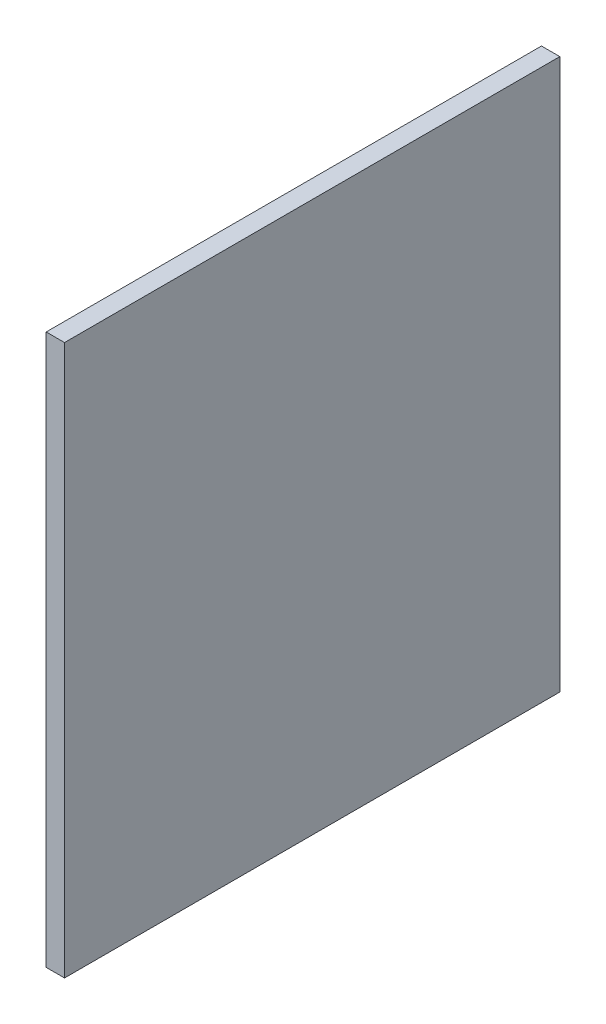
ISO-10303-21;
HEADER;
FILE_DESCRIPTION(('STEP AP214'),'2;1');
FILE_NAME('part.step','',(''),(''),'','','');
FILE_SCHEMA(('AUTOMOTIVE_DESIGN { 1 0 10303 214 1 1 1 1 }'));
ENDSEC;
DATA;
#1=APPLICATION_CONTEXT('core data for automotive mechanical design processes');
#2=APPLICATION_PROTOCOL_DEFINITION('international standard','automotive_design',2000,#1);
#3=PRODUCT_CONTEXT('',#1,'mechanical');
#4=PRODUCT('Part','Part','',(#3));
#5=PRODUCT_RELATED_PRODUCT_CATEGORY('part','',(#4));
#6=PRODUCT_DEFINITION_FORMATION('','',#4);
#7=PRODUCT_DEFINITION_CONTEXT('part definition',#1,'design');
#8=PRODUCT_DEFINITION('design','',#6,#7);
#9=PRODUCT_DEFINITION_SHAPE('','',#8);
#10=(LENGTH_UNIT() NAMED_UNIT(*) SI_UNIT(.MILLI.,.METRE.));
#11=(NAMED_UNIT(*) PLANE_ANGLE_UNIT() SI_UNIT($,.RADIAN.));
#12=(NAMED_UNIT(*) SI_UNIT($,.STERADIAN.) SOLID_ANGLE_UNIT());
#13=UNCERTAINTY_MEASURE_WITH_UNIT(LENGTH_MEASURE(1.E-05),#10,'distance_accuracy_value','');
#14=(GEOMETRIC_REPRESENTATION_CONTEXT(3) GLOBAL_UNCERTAINTY_ASSIGNED_CONTEXT((#13)) GLOBAL_UNIT_ASSIGNED_CONTEXT((#10,
#11,#12)) REPRESENTATION_CONTEXT('',''));
#15=CARTESIAN_POINT('',(0.,0.,0.));
#16=DIRECTION('',(0.,0.,1.));
#17=DIRECTION('',(1.,0.,0.));
#18=AXIS2_PLACEMENT_3D('',#15,#16,#17);
#19=CARTESIAN_POINT('',(10.,33.6868343959119,-225.871489997975));
#20=DIRECTION('',(0.,-1.,0.));
#21=DIRECTION('',(0.,0.,-1.));
#22=AXIS2_PLACEMENT_3D('',#19,#20,#21);
#23=PLANE('',#22);
#24=DIRECTION('',(0.,0.,1.));
#25=VECTOR('',#24,1.);
#26=CARTESIAN_POINT('',(0.,33.6868343959119,-225.871489997975));
#27=LINE('',#26,#25);
#28=CARTESIAN_POINT('',(0.,33.6868343959119,-225.871489997975));
#29=VERTEX_POINT('',#28);
#30=CARTESIAN_POINT('',(0.,33.6868343959119,44.1285100020248));
#31=VERTEX_POINT('',#30);
#32=EDGE_CURVE('E98',#29,#31,#27,.T.);
#33=ORIENTED_EDGE('',*,*,#32,.T.);
#34=DIRECTION('',(-1.,0.,0.));
#35=VECTOR('',#34,1.);
#36=CARTESIAN_POINT('',(10.,33.6868343959119,44.1285100020248));
#37=LINE('',#36,#35);
#38=CARTESIAN_POINT('',(10.,33.6868343959119,44.1285100020248));
#39=VERTEX_POINT('',#38);
#40=EDGE_CURVE('E11',#39,#31,#37,.T.);
#41=ORIENTED_EDGE('',*,*,#40,.F.);
#42=DIRECTION('',(0.,0.,1.));
#43=VECTOR('',#42,1.);
#44=CARTESIAN_POINT('',(10.,33.6868343959119,-225.871489997975));
#45=LINE('',#44,#43);
#46=CARTESIAN_POINT('',(10.,33.6868343959119,-225.871489997975));
#47=VERTEX_POINT('',#46);
#48=EDGE_CURVE('E85',#47,#39,#45,.T.);
#49=ORIENTED_EDGE('',*,*,#48,.F.);
#50=DIRECTION('',(-1.,0.,0.));
#51=VECTOR('',#50,1.);
#52=CARTESIAN_POINT('',(10.,33.6868343959119,-225.871489997975));
#53=LINE('',#52,#51);
#54=EDGE_CURVE('E94',#47,#29,#53,.T.);
#55=ORIENTED_EDGE('',*,*,#54,.T.);
#56=EDGE_LOOP('',(#33,#41,#49,#55));
#57=FACE_BOUND('',#56,.T.);
#58=ADVANCED_FACE('F35',(#57),#23,.F.);
#59=CARTESIAN_POINT('',(10.,33.6868343959119,44.1285100020248));
#60=DIRECTION('',(0.,0.,-1.));
#61=DIRECTION('',(-1.,0.,0.));
#62=AXIS2_PLACEMENT_3D('',#59,#60,#61);
#63=PLANE('',#62);
#64=DIRECTION('',(0.,-1.,0.));
#65=VECTOR('',#64,1.);
#66=CARTESIAN_POINT('',(0.,33.6868343959119,44.1285100020248));
#67=LINE('',#66,#65);
#68=CARTESIAN_POINT('',(0.,-266.313165604088,44.1285100020248));
#69=VERTEX_POINT('',#68);
#70=EDGE_CURVE('E90',#31,#69,#67,.T.);
#71=ORIENTED_EDGE('',*,*,#70,.T.);
#72=DIRECTION('',(-1.,0.,0.));
#73=VECTOR('',#72,1.);
#74=CARTESIAN_POINT('',(10.,-266.313165604088,44.1285100020248));
#75=LINE('',#74,#73);
#76=CARTESIAN_POINT('',(10.,-266.313165604088,44.1285100020248));
#77=VERTEX_POINT('',#76);
#78=EDGE_CURVE('E43',#77,#69,#75,.T.);
#79=ORIENTED_EDGE('',*,*,#78,.F.);
#80=DIRECTION('',(0.,-1.,0.));
#81=VECTOR('',#80,1.);
#82=CARTESIAN_POINT('',(10.,33.6868343959119,44.1285100020248));
#83=LINE('',#82,#81);
#84=EDGE_CURVE('E80',#39,#77,#83,.T.);
#85=ORIENTED_EDGE('',*,*,#84,.F.);
#86=ORIENTED_EDGE('',*,*,#40,.T.);
#87=EDGE_LOOP('',(#71,#79,#85,#86));
#88=FACE_BOUND('',#87,.T.);
#89=ADVANCED_FACE('F89',(#88),#63,.F.);
#90=CARTESIAN_POINT('',(10.,-266.313165604088,-205.871489997975));
#91=DIRECTION('',(0.,1.,0.));
#92=DIRECTION('',(0.,0.,1.));
#93=AXIS2_PLACEMENT_3D('',#90,#91,#92);
#94=PLANE('',#93);
#95=DIRECTION('',(0.,0.,-1.));
#96=VECTOR('',#95,1.);
#97=CARTESIAN_POINT('',(0.,-266.313165604088,-205.871489997975));
#98=LINE('',#97,#96);
#99=CARTESIAN_POINT('',(0.,-266.313165604088,-225.871489997975));
#100=VERTEX_POINT('',#99);
#101=EDGE_CURVE('E67',#69,#100,#98,.T.);
#102=ORIENTED_EDGE('',*,*,#101,.T.);
#103=DIRECTION('',(-1.,0.,0.));
#104=VECTOR('',#103,1.);
#105=CARTESIAN_POINT('',(10.,-266.313165604088,-225.871489997975));
#106=LINE('',#105,#104);
#107=CARTESIAN_POINT('',(10.,-266.313165604088,-225.871489997975));
#108=VERTEX_POINT('',#107);
#109=EDGE_CURVE('E91',#108,#100,#106,.T.);
#110=ORIENTED_EDGE('',*,*,#109,.F.);
#111=DIRECTION('',(0.,0.,-1.));
#112=VECTOR('',#111,1.);
#113=CARTESIAN_POINT('',(10.,-266.313165604088,44.1285100020248));
#114=LINE('',#113,#112);
#115=EDGE_CURVE('E83',#77,#108,#114,.T.);
#116=ORIENTED_EDGE('',*,*,#115,.F.);
#117=ORIENTED_EDGE('',*,*,#78,.T.);
#118=EDGE_LOOP('',(#102,#110,#116,#117));
#119=FACE_BOUND('',#118,.T.);
#120=ADVANCED_FACE('F92',(#119),#94,.F.);
#121=CARTESIAN_POINT('',(10.,-266.313165604088,-225.871489997975));
#122=DIRECTION('',(0.,0.,1.));
#123=DIRECTION('',(1.,0.,0.));
#124=AXIS2_PLACEMENT_3D('',#121,#122,#123);
#125=PLANE('',#124);
#126=DIRECTION('',(0.,1.,0.));
#127=VECTOR('',#126,1.);
#128=CARTESIAN_POINT('',(0.,-266.313165604088,-225.871489997975));
#129=LINE('',#128,#127);
#130=EDGE_CURVE('E73',#100,#29,#129,.T.);
#131=ORIENTED_EDGE('',*,*,#130,.T.);
#132=ORIENTED_EDGE('',*,*,#54,.F.);
#133=DIRECTION('',(0.,1.,0.));
#134=VECTOR('',#133,1.);
#135=CARTESIAN_POINT('',(10.,-266.313165604088,-225.871489997975));
#136=LINE('',#135,#134);
#137=EDGE_CURVE('E51',#108,#47,#136,.T.);
#138=ORIENTED_EDGE('',*,*,#137,.F.);
#139=ORIENTED_EDGE('',*,*,#109,.T.);
#140=EDGE_LOOP('',(#131,#132,#138,#139));
#141=FACE_BOUND('',#140,.T.);
#142=ADVANCED_FACE('F105',(#141),#125,.F.);
#143=CARTESIAN_POINT('',(10.,0.,0.));
#144=DIRECTION('',(1.,0.,0.));
#145=DIRECTION('',(0.,0.,-1.));
#146=AXIS2_PLACEMENT_3D('',#143,#144,#145);
#147=PLANE('',#146);
#148=ORIENTED_EDGE('',*,*,#48,.T.);
#149=ORIENTED_EDGE('',*,*,#84,.T.);
#150=ORIENTED_EDGE('',*,*,#115,.T.);
#151=ORIENTED_EDGE('',*,*,#137,.T.);
#152=EDGE_LOOP('',(#148,#149,#150,#151));
#153=FACE_BOUND('',#152,.T.);
#154=ADVANCED_FACE('F81',(#153),#147,.T.);
#155=CARTESIAN_POINT('',(0.,0.,0.));
#156=DIRECTION('',(1.,0.,0.));
#157=DIRECTION('',(0.,0.,-1.));
#158=AXIS2_PLACEMENT_3D('',#155,#156,#157);
#159=PLANE('',#158);
#160=ORIENTED_EDGE('',*,*,#32,.F.);
#161=ORIENTED_EDGE('',*,*,#130,.F.);
#162=ORIENTED_EDGE('',*,*,#101,.F.);
#163=ORIENTED_EDGE('',*,*,#70,.F.);
#164=EDGE_LOOP('',(#160,#161,#162,#163));
#165=FACE_BOUND('',#164,.T.);
#166=ADVANCED_FACE('F108',(#165),#159,.F.);
#167=CLOSED_SHELL('',(#58,#89,#120,#142,#154,#166));
#168=MANIFOLD_SOLID_BREP('B2',#167);
#169=ADVANCED_BREP_SHAPE_REPRESENTATION('',(#18,#168),#14);
#170=SHAPE_DEFINITION_REPRESENTATION(#9,#169);
ENDSEC;
END-ISO-10303-21;
